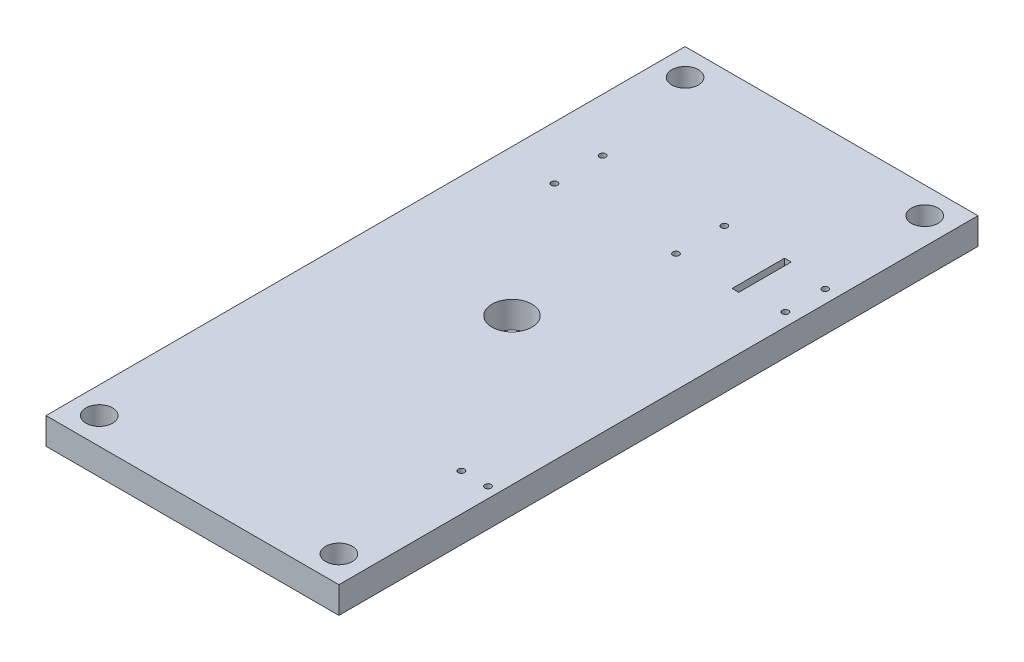
ISO-10303-21;
HEADER;
FILE_DESCRIPTION(('STEP AP214'),'2;1');
FILE_NAME('part.step','',(''),(''),'','','');
FILE_SCHEMA(('AUTOMOTIVE_DESIGN { 1 0 10303 214 1 1 1 1 }'));
ENDSEC;
DATA;
#1=APPLICATION_CONTEXT('core data for automotive mechanical design processes');
#2=APPLICATION_PROTOCOL_DEFINITION('international standard','automotive_design',2000,#1);
#3=PRODUCT_CONTEXT('',#1,'mechanical');
#4=PRODUCT('Part','Part','',(#3));
#5=PRODUCT_RELATED_PRODUCT_CATEGORY('part','',(#4));
#6=PRODUCT_DEFINITION_FORMATION('','',#4);
#7=PRODUCT_DEFINITION_CONTEXT('part definition',#1,'design');
#8=PRODUCT_DEFINITION('design','',#6,#7);
#9=PRODUCT_DEFINITION_SHAPE('','',#8);
#10=(LENGTH_UNIT() NAMED_UNIT(*) SI_UNIT(.MILLI.,.METRE.));
#11=(NAMED_UNIT(*) PLANE_ANGLE_UNIT() SI_UNIT($,.RADIAN.));
#12=(NAMED_UNIT(*) SI_UNIT($,.STERADIAN.) SOLID_ANGLE_UNIT());
#13=UNCERTAINTY_MEASURE_WITH_UNIT(LENGTH_MEASURE(1.E-05),#10,'distance_accuracy_value','');
#14=(GEOMETRIC_REPRESENTATION_CONTEXT(3) GLOBAL_UNCERTAINTY_ASSIGNED_CONTEXT((#13)) GLOBAL_UNIT_ASSIGNED_CONTEXT((#10,
#11,#12)) REPRESENTATION_CONTEXT('',''));
#15=CARTESIAN_POINT('',(0.,0.,0.));
#16=DIRECTION('',(0.,0.,1.));
#17=DIRECTION('',(1.,0.,0.));
#18=AXIS2_PLACEMENT_3D('',#15,#16,#17);
#19=CARTESIAN_POINT('',(0.,12.7,0.));
#20=DIRECTION('',(1.,0.,0.));
#21=DIRECTION('',(0.,0.,-1.));
#22=AXIS2_PLACEMENT_3D('',#19,#20,#21);
#23=PLANE('',#22);
#24=DIRECTION('',(0.,0.,1.));
#25=VECTOR('',#24,1.);
#26=CARTESIAN_POINT('',(0.,0.,0.));
#27=LINE('',#26,#25);
#28=CARTESIAN_POINT('',(0.,0.,-304.8));
#29=VERTEX_POINT('',#28);
#30=CARTESIAN_POINT('',(0.,0.,0.));
#31=VERTEX_POINT('',#30);
#32=EDGE_CURVE('E211',#29,#31,#27,.T.);
#33=ORIENTED_EDGE('',*,*,#32,.T.);
#34=DIRECTION('',(0.,-1.,0.));
#35=VECTOR('',#34,1.);
#36=CARTESIAN_POINT('',(0.,12.7,0.));
#37=LINE('',#36,#35);
#38=CARTESIAN_POINT('',(0.,12.7,0.));
#39=VERTEX_POINT('',#38);
#40=EDGE_CURVE('E11',#39,#31,#37,.T.);
#41=ORIENTED_EDGE('',*,*,#40,.F.);
#42=DIRECTION('',(0.,0.,1.));
#43=VECTOR('',#42,1.);
#44=CARTESIAN_POINT('',(0.,12.7,0.));
#45=LINE('',#44,#43);
#46=CARTESIAN_POINT('',(0.,12.7,-304.8));
#47=VERTEX_POINT('',#46);
#48=EDGE_CURVE('E214',#47,#39,#45,.T.);
#49=ORIENTED_EDGE('',*,*,#48,.F.);
#50=DIRECTION('',(0.,-1.,0.));
#51=VECTOR('',#50,1.);
#52=CARTESIAN_POINT('',(0.,12.7,-304.8));
#53=LINE('',#52,#51);
#54=EDGE_CURVE('E224',#47,#29,#53,.T.);
#55=ORIENTED_EDGE('',*,*,#54,.T.);
#56=EDGE_LOOP('',(#33,#41,#49,#55));
#57=FACE_BOUND('',#56,.T.);
#58=ADVANCED_FACE('F37',(#57),#23,.F.);
#59=CARTESIAN_POINT('',(0.,12.7,0.));
#60=DIRECTION('',(0.,0.,-1.));
#61=DIRECTION('',(-1.,0.,0.));
#62=AXIS2_PLACEMENT_3D('',#59,#60,#61);
#63=PLANE('',#62);
#64=DIRECTION('',(1.,0.,0.));
#65=VECTOR('',#64,1.);
#66=CARTESIAN_POINT('',(0.,0.,0.));
#67=LINE('',#66,#65);
#68=CARTESIAN_POINT('',(139.7,0.,0.));
#69=VERTEX_POINT('',#68);
#70=EDGE_CURVE('E227',#31,#69,#67,.T.);
#71=ORIENTED_EDGE('',*,*,#70,.T.);
#72=DIRECTION('',(0.,-1.,0.));
#73=VECTOR('',#72,1.);
#74=CARTESIAN_POINT('',(139.7,12.7,0.));
#75=LINE('',#74,#73);
#76=CARTESIAN_POINT('',(139.7,12.7,0.));
#77=VERTEX_POINT('',#76);
#78=EDGE_CURVE('E44',#77,#69,#75,.T.);
#79=ORIENTED_EDGE('',*,*,#78,.F.);
#80=DIRECTION('',(1.,0.,0.));
#81=VECTOR('',#80,1.);
#82=CARTESIAN_POINT('',(0.,12.7,0.));
#83=LINE('',#82,#81);
#84=EDGE_CURVE('E217',#39,#77,#83,.T.);
#85=ORIENTED_EDGE('',*,*,#84,.F.);
#86=ORIENTED_EDGE('',*,*,#40,.T.);
#87=EDGE_LOOP('',(#71,#79,#85,#86));
#88=FACE_BOUND('',#87,.T.);
#89=ADVANCED_FACE('F256',(#88),#63,.F.);
#90=CARTESIAN_POINT('',(139.7,12.7,0.));
#91=DIRECTION('',(-1.,0.,0.));
#92=DIRECTION('',(0.,0.,1.));
#93=AXIS2_PLACEMENT_3D('',#90,#91,#92);
#94=PLANE('',#93);
#95=DIRECTION('',(0.,0.,-1.));
#96=VECTOR('',#95,1.);
#97=CARTESIAN_POINT('',(139.7,0.,0.));
#98=LINE('',#97,#96);
#99=CARTESIAN_POINT('',(139.7,0.,-304.8));
#100=VERTEX_POINT('',#99);
#101=EDGE_CURVE('E229',#69,#100,#98,.T.);
#102=ORIENTED_EDGE('',*,*,#101,.T.);
#103=DIRECTION('',(0.,-1.,0.));
#104=VECTOR('',#103,1.);
#105=CARTESIAN_POINT('',(139.7,12.7,-304.8));
#106=LINE('',#105,#104);
#107=CARTESIAN_POINT('',(139.7,12.7,-304.8));
#108=VERTEX_POINT('',#107);
#109=EDGE_CURVE('E234',#108,#100,#106,.T.);
#110=ORIENTED_EDGE('',*,*,#109,.F.);
#111=DIRECTION('',(0.,0.,-1.));
#112=VECTOR('',#111,1.);
#113=CARTESIAN_POINT('',(139.7,12.7,0.));
#114=LINE('',#113,#112);
#115=EDGE_CURVE('E220',#77,#108,#114,.T.);
#116=ORIENTED_EDGE('',*,*,#115,.F.);
#117=ORIENTED_EDGE('',*,*,#78,.T.);
#118=EDGE_LOOP('',(#102,#110,#116,#117));
#119=FACE_BOUND('',#118,.T.);
#120=ADVANCED_FACE('F241',(#119),#94,.F.);
#121=CARTESIAN_POINT('',(0.,12.7,-304.8));
#122=DIRECTION('',(0.,0.,1.));
#123=DIRECTION('',(1.,0.,0.));
#124=AXIS2_PLACEMENT_3D('',#121,#122,#123);
#125=PLANE('',#124);
#126=DIRECTION('',(-1.,0.,0.));
#127=VECTOR('',#126,1.);
#128=CARTESIAN_POINT('',(0.,0.,-304.8));
#129=LINE('',#128,#127);
#130=EDGE_CURVE('E218',#100,#29,#129,.T.);
#131=ORIENTED_EDGE('',*,*,#130,.T.);
#132=ORIENTED_EDGE('',*,*,#54,.F.);
#133=DIRECTION('',(-1.,0.,0.));
#134=VECTOR('',#133,1.);
#135=CARTESIAN_POINT('',(0.,12.7,-304.8));
#136=LINE('',#135,#134);
#137=EDGE_CURVE('E222',#108,#47,#136,.T.);
#138=ORIENTED_EDGE('',*,*,#137,.F.);
#139=ORIENTED_EDGE('',*,*,#109,.T.);
#140=EDGE_LOOP('',(#131,#132,#138,#139));
#141=FACE_BOUND('',#140,.T.);
#142=ADVANCED_FACE('F249',(#141),#125,.F.);
#143=CARTESIAN_POINT('',(0.,12.7,0.));
#144=DIRECTION('',(0.,-1.,0.));
#145=DIRECTION('',(0.,0.,-1.));
#146=AXIS2_PLACEMENT_3D('',#143,#144,#145);
#147=PLANE('',#146);
#148=DIRECTION('',(1.,0.,0.));
#149=VECTOR('',#148,1.);
#150=CARTESIAN_POINT('',(111.125,12.7,-216.1));
#151=LINE('',#150,#149);
#152=CARTESIAN_POINT('',(111.125,12.7,-216.1));
#153=VERTEX_POINT('',#152);
#154=CARTESIAN_POINT('',(114.3,12.7,-216.1));
#155=VERTEX_POINT('',#154);
#156=EDGE_CURVE('E131',#153,#155,#151,.T.);
#157=ORIENTED_EDGE('',*,*,#156,.F.);
#158=DIRECTION('',(0.,0.,1.));
#159=VECTOR('',#158,1.);
#160=CARTESIAN_POINT('',(111.125,12.7,-216.1));
#161=LINE('',#160,#159);
#162=CARTESIAN_POINT('',(111.125,12.7,-241.1));
#163=VERTEX_POINT('',#162);
#164=EDGE_CURVE('E51',#163,#153,#161,.T.);
#165=ORIENTED_EDGE('',*,*,#164,.F.);
#166=DIRECTION('',(-1.,0.,0.));
#167=VECTOR('',#166,1.);
#168=CARTESIAN_POINT('',(111.125,12.7,-241.1));
#169=LINE('',#168,#167);
#170=CARTESIAN_POINT('',(114.3,12.7,-241.1));
#171=VERTEX_POINT('',#170);
#172=EDGE_CURVE('E119',#171,#163,#169,.T.);
#173=ORIENTED_EDGE('',*,*,#172,.F.);
#174=DIRECTION('',(0.,0.,-1.));
#175=VECTOR('',#174,1.);
#176=CARTESIAN_POINT('',(114.3,12.7,-216.1));
#177=LINE('',#176,#175);
#178=EDGE_CURVE('E122',#155,#171,#177,.T.);
#179=ORIENTED_EDGE('',*,*,#178,.F.);
#180=EDGE_LOOP('',(#157,#165,#173,#179));
#181=FACE_BOUND('',#180,.T.);
#182=CARTESIAN_POINT('',(133.52,12.7,-238.10000005));
#183=DIRECTION('',(0.,1.,0.));
#184=DIRECTION('',(0.,0.,1.));
#185=AXIS2_PLACEMENT_3D('',#182,#183,#184);
#186=CIRCLE('',#185,1.5);
#187=CARTESIAN_POINT('',(133.52,12.7,-236.60000005));
#188=VERTEX_POINT('',#187);
#189=EDGE_CURVE('E125',#188,#188,#186,.T.);
#190=ORIENTED_EDGE('',*,*,#189,.F.);
#191=EDGE_LOOP('',(#190));
#192=FACE_BOUND('',#191,.T.);
#193=CARTESIAN_POINT('',(133.52,12.7,-219.09999995));
#194=DIRECTION('',(0.,1.,0.));
#195=DIRECTION('',(0.,0.,1.));
#196=AXIS2_PLACEMENT_3D('',#193,#194,#195);
#197=CIRCLE('',#196,1.5);
#198=CARTESIAN_POINT('',(133.52,12.7,-217.59999995));
#199=VERTEX_POINT('',#198);
#200=EDGE_CURVE('E144',#199,#199,#197,.T.);
#201=ORIENTED_EDGE('',*,*,#200,.F.);
#202=EDGE_LOOP('',(#201));
#203=FACE_BOUND('',#202,.T.);
#204=CARTESIAN_POINT('',(134.62,12.7,-76.2));
#205=DIRECTION('',(0.,1.,0.));
#206=DIRECTION('',(0.,0.,1.));
#207=AXIS2_PLACEMENT_3D('',#204,#205,#206);
#208=CIRCLE('',#207,1.5);
#209=CARTESIAN_POINT('',(134.62,12.7,-74.7));
#210=VERTEX_POINT('',#209);
#211=EDGE_CURVE('E152',#210,#210,#208,.T.);
#212=ORIENTED_EDGE('',*,*,#211,.F.);
#213=EDGE_LOOP('',(#212));
#214=FACE_BOUND('',#213,.T.);
#215=CARTESIAN_POINT('',(121.92,12.7,-76.2));
#216=DIRECTION('',(0.,1.,0.));
#217=DIRECTION('',(0.,0.,1.));
#218=AXIS2_PLACEMENT_3D('',#215,#216,#217);
#219=CIRCLE('',#218,1.5);
#220=CARTESIAN_POINT('',(121.92,12.7,-74.7));
#221=VERTEX_POINT('',#220);
#222=EDGE_CURVE('E143',#221,#221,#219,.T.);
#223=ORIENTED_EDGE('',*,*,#222,.F.);
#224=EDGE_LOOP('',(#223));
#225=FACE_BOUND('',#224,.T.);
#226=CARTESIAN_POINT('',(83.400011,12.7,-217.0999976));
#227=DIRECTION('',(0.,1.,0.));
#228=DIRECTION('',(0.,0.,1.));
#229=AXIS2_PLACEMENT_3D('',#226,#227,#228);
#230=CIRCLE('',#229,1.5);
#231=CARTESIAN_POINT('',(83.400011,12.7,-215.5999976));
#232=VERTEX_POINT('',#231);
#233=EDGE_CURVE('E151',#232,#232,#230,.T.);
#234=ORIENTED_EDGE('',*,*,#233,.F.);
#235=EDGE_LOOP('',(#234));
#236=FACE_BOUND('',#235,.T.);
#237=CARTESIAN_POINT('',(83.400011,12.7,-240.1000024));
#238=DIRECTION('',(0.,1.,0.));
#239=DIRECTION('',(0.,0.,1.));
#240=AXIS2_PLACEMENT_3D('',#237,#238,#239);
#241=CIRCLE('',#240,1.5);
#242=CARTESIAN_POINT('',(83.400011,12.7,-238.6000024));
#243=VERTEX_POINT('',#242);
#244=EDGE_CURVE('E170',#243,#243,#241,.T.);
#245=ORIENTED_EDGE('',*,*,#244,.F.);
#246=EDGE_LOOP('',(#245));
#247=FACE_BOUND('',#246,.T.);
#248=CARTESIAN_POINT('',(25.4,12.7,-240.1000024));
#249=DIRECTION('',(0.,1.,0.));
#250=DIRECTION('',(0.,0.,1.));
#251=AXIS2_PLACEMENT_3D('',#248,#249,#250);
#252=CIRCLE('',#251,1.5);
#253=CARTESIAN_POINT('',(25.4,12.7,-238.6000024));
#254=VERTEX_POINT('',#253);
#255=EDGE_CURVE('E164',#254,#254,#252,.T.);
#256=ORIENTED_EDGE('',*,*,#255,.F.);
#257=EDGE_LOOP('',(#256));
#258=FACE_BOUND('',#257,.T.);
#259=CARTESIAN_POINT('',(25.4,12.7,-217.0999976));
#260=DIRECTION('',(0.,1.,0.));
#261=DIRECTION('',(0.,0.,1.));
#262=AXIS2_PLACEMENT_3D('',#259,#260,#261);
#263=CIRCLE('',#262,1.5);
#264=CARTESIAN_POINT('',(25.4,12.7,-215.5999976));
#265=VERTEX_POINT('',#264);
#266=EDGE_CURVE('E163',#265,#265,#263,.T.);
#267=ORIENTED_EDGE('',*,*,#266,.F.);
#268=EDGE_LOOP('',(#267));
#269=FACE_BOUND('',#268,.T.);
#270=CARTESIAN_POINT('',(69.85,12.7,-152.4));
#271=DIRECTION('',(0.,1.,0.));
#272=DIRECTION('',(0.,0.,1.));
#273=AXIS2_PLACEMENT_3D('',#270,#271,#272);
#274=CIRCLE('',#273,9.52499999999999);
#275=CARTESIAN_POINT('',(69.85,12.7,-142.875));
#276=VERTEX_POINT('',#275);
#277=EDGE_CURVE('E181',#276,#276,#274,.T.);
#278=ORIENTED_EDGE('',*,*,#277,.F.);
#279=EDGE_LOOP('',(#278));
#280=FACE_BOUND('',#279,.T.);
#281=CARTESIAN_POINT('',(12.7,12.7,-12.7));
#282=DIRECTION('',(0.,1.,0.));
#283=DIRECTION('',(0.,0.,1.));
#284=AXIS2_PLACEMENT_3D('',#281,#282,#283);
#285=CIRCLE('',#284,6.35);
#286=CARTESIAN_POINT('',(12.7,12.7,-6.35));
#287=VERTEX_POINT('',#286);
#288=EDGE_CURVE('E189',#287,#287,#285,.T.);
#289=ORIENTED_EDGE('',*,*,#288,.F.);
#290=EDGE_LOOP('',(#289));
#291=FACE_BOUND('',#290,.T.);
#292=CARTESIAN_POINT('',(12.6999999999999,12.7,-292.1));
#293=DIRECTION('',(0.,1.,0.));
#294=DIRECTION('',(0.,0.,-1.));
#295=AXIS2_PLACEMENT_3D('',#292,#293,#294);
#296=CIRCLE('',#295,6.35000000000001);
#297=CARTESIAN_POINT('',(12.6999999999999,12.7,-298.45));
#298=VERTEX_POINT('',#297);
#299=EDGE_CURVE('E200',#298,#298,#296,.T.);
#300=ORIENTED_EDGE('',*,*,#299,.F.);
#301=EDGE_LOOP('',(#300));
#302=FACE_BOUND('',#301,.T.);
#303=CARTESIAN_POINT('',(127.,12.7,-292.1));
#304=DIRECTION('',(0.,1.,0.));
#305=DIRECTION('',(0.,0.,1.));
#306=AXIS2_PLACEMENT_3D('',#303,#304,#305);
#307=CIRCLE('',#306,6.35000000000001);
#308=CARTESIAN_POINT('',(127.,12.7,-285.75));
#309=VERTEX_POINT('',#308);
#310=EDGE_CURVE('E194',#309,#309,#307,.T.);
#311=ORIENTED_EDGE('',*,*,#310,.F.);
#312=EDGE_LOOP('',(#311));
#313=FACE_BOUND('',#312,.T.);
#314=CARTESIAN_POINT('',(127.,12.7,-12.7000000000002));
#315=DIRECTION('',(0.,1.,0.));
#316=DIRECTION('',(0.,0.,-1.));
#317=AXIS2_PLACEMENT_3D('',#314,#315,#316);
#318=CIRCLE('',#317,6.35);
#319=CARTESIAN_POINT('',(127.,12.7,-19.0500000000002));
#320=VERTEX_POINT('',#319);
#321=EDGE_CURVE('E193',#320,#320,#318,.T.);
#322=ORIENTED_EDGE('',*,*,#321,.F.);
#323=EDGE_LOOP('',(#322));
#324=FACE_BOUND('',#323,.T.);
#325=ORIENTED_EDGE('',*,*,#48,.T.);
#326=ORIENTED_EDGE('',*,*,#84,.T.);
#327=ORIENTED_EDGE('',*,*,#115,.T.);
#328=ORIENTED_EDGE('',*,*,#137,.T.);
#329=EDGE_LOOP('',(#325,#326,#327,#328));
#330=FACE_BOUND('',#329,.T.);
#331=ADVANCED_FACE('F255',(#181,#192,#203,#214,#225,#236,#247,#258,#269,#280,#291,#302,#313,
#324,#330),#147,.F.);
#332=CARTESIAN_POINT('',(0.,0.,0.));
#333=DIRECTION('',(0.,-1.,0.));
#334=DIRECTION('',(0.,0.,-1.));
#335=AXIS2_PLACEMENT_3D('',#332,#333,#334);
#336=PLANE('',#335);
#337=DIRECTION('',(0.,0.,1.));
#338=VECTOR('',#337,1.);
#339=CARTESIAN_POINT('',(111.125,0.,-216.1));
#340=LINE('',#339,#338);
#341=CARTESIAN_POINT('',(111.125,0.,-241.1));
#342=VERTEX_POINT('',#341);
#343=CARTESIAN_POINT('',(111.125,0.,-216.1));
#344=VERTEX_POINT('',#343);
#345=EDGE_CURVE('E103',#342,#344,#340,.T.);
#346=ORIENTED_EDGE('',*,*,#345,.T.);
#347=DIRECTION('',(1.,0.,0.));
#348=VECTOR('',#347,1.);
#349=CARTESIAN_POINT('',(111.125,0.,-216.1));
#350=LINE('',#349,#348);
#351=CARTESIAN_POINT('',(114.3,0.,-216.1));
#352=VERTEX_POINT('',#351);
#353=EDGE_CURVE('E112',#344,#352,#350,.T.);
#354=ORIENTED_EDGE('',*,*,#353,.T.);
#355=DIRECTION('',(0.,0.,-1.));
#356=VECTOR('',#355,1.);
#357=CARTESIAN_POINT('',(114.3,0.,-216.1));
#358=LINE('',#357,#356);
#359=CARTESIAN_POINT('',(114.3,0.,-241.1));
#360=VERTEX_POINT('',#359);
#361=EDGE_CURVE('E59',#352,#360,#358,.T.);
#362=ORIENTED_EDGE('',*,*,#361,.T.);
#363=DIRECTION('',(-1.,0.,0.));
#364=VECTOR('',#363,1.);
#365=CARTESIAN_POINT('',(111.125,0.,-241.1));
#366=LINE('',#365,#364);
#367=EDGE_CURVE('E109',#360,#342,#366,.T.);
#368=ORIENTED_EDGE('',*,*,#367,.T.);
#369=EDGE_LOOP('',(#346,#354,#362,#368));
#370=FACE_BOUND('',#369,.T.);
#371=CARTESIAN_POINT('',(133.52,0.,-238.10000005));
#372=DIRECTION('',(0.,1.,0.));
#373=DIRECTION('',(0.,0.,1.));
#374=AXIS2_PLACEMENT_3D('',#371,#372,#373);
#375=CIRCLE('',#374,1.5);
#376=CARTESIAN_POINT('',(133.52,0.,-236.60000005));
#377=VERTEX_POINT('',#376);
#378=EDGE_CURVE('E147',#377,#377,#375,.T.);
#379=ORIENTED_EDGE('',*,*,#378,.T.);
#380=EDGE_LOOP('',(#379));
#381=FACE_BOUND('',#380,.T.);
#382=CARTESIAN_POINT('',(133.52,0.,-219.09999995));
#383=DIRECTION('',(0.,1.,0.));
#384=DIRECTION('',(0.,0.,1.));
#385=AXIS2_PLACEMENT_3D('',#382,#383,#384);
#386=CIRCLE('',#385,1.5);
#387=CARTESIAN_POINT('',(133.52,0.,-217.59999995));
#388=VERTEX_POINT('',#387);
#389=EDGE_CURVE('E140',#388,#388,#386,.T.);
#390=ORIENTED_EDGE('',*,*,#389,.T.);
#391=EDGE_LOOP('',(#390));
#392=FACE_BOUND('',#391,.T.);
#393=CARTESIAN_POINT('',(134.62,0.,-76.2));
#394=DIRECTION('',(0.,1.,0.));
#395=DIRECTION('',(0.,0.,1.));
#396=AXIS2_PLACEMENT_3D('',#393,#394,#395);
#397=CIRCLE('',#396,1.5);
#398=CARTESIAN_POINT('',(134.62,0.,-74.7));
#399=VERTEX_POINT('',#398);
#400=EDGE_CURVE('E148',#399,#399,#397,.T.);
#401=ORIENTED_EDGE('',*,*,#400,.T.);
#402=EDGE_LOOP('',(#401));
#403=FACE_BOUND('',#402,.T.);
#404=CARTESIAN_POINT('',(121.92,0.,-76.2));
#405=DIRECTION('',(0.,1.,0.));
#406=DIRECTION('',(0.,0.,1.));
#407=AXIS2_PLACEMENT_3D('',#404,#405,#406);
#408=CIRCLE('',#407,1.5);
#409=CARTESIAN_POINT('',(121.92,0.,-74.7));
#410=VERTEX_POINT('',#409);
#411=EDGE_CURVE('E155',#410,#410,#408,.T.);
#412=ORIENTED_EDGE('',*,*,#411,.T.);
#413=EDGE_LOOP('',(#412));
#414=FACE_BOUND('',#413,.T.);
#415=CARTESIAN_POINT('',(83.400011,0.,-217.0999976));
#416=DIRECTION('',(0.,1.,0.));
#417=DIRECTION('',(0.,0.,1.));
#418=AXIS2_PLACEMENT_3D('',#415,#416,#417);
#419=CIRCLE('',#418,1.5);
#420=CARTESIAN_POINT('',(83.400011,0.,-215.5999976));
#421=VERTEX_POINT('',#420);
#422=EDGE_CURVE('E173',#421,#421,#419,.T.);
#423=ORIENTED_EDGE('',*,*,#422,.T.);
#424=EDGE_LOOP('',(#423));
#425=FACE_BOUND('',#424,.T.);
#426=CARTESIAN_POINT('',(83.400011,0.,-240.1000024));
#427=DIRECTION('',(0.,1.,0.));
#428=DIRECTION('',(0.,0.,1.));
#429=AXIS2_PLACEMENT_3D('',#426,#427,#428);
#430=CIRCLE('',#429,1.5);
#431=CARTESIAN_POINT('',(83.400011,0.,-238.6000024));
#432=VERTEX_POINT('',#431);
#433=EDGE_CURVE('E167',#432,#432,#430,.T.);
#434=ORIENTED_EDGE('',*,*,#433,.T.);
#435=EDGE_LOOP('',(#434));
#436=FACE_BOUND('',#435,.T.);
#437=CARTESIAN_POINT('',(25.4,0.,-240.1000024));
#438=DIRECTION('',(0.,1.,0.));
#439=DIRECTION('',(0.,0.,1.));
#440=AXIS2_PLACEMENT_3D('',#437,#438,#439);
#441=CIRCLE('',#440,1.5);
#442=CARTESIAN_POINT('',(25.4,0.,-238.6000024));
#443=VERTEX_POINT('',#442);
#444=EDGE_CURVE('E160',#443,#443,#441,.T.);
#445=ORIENTED_EDGE('',*,*,#444,.T.);
#446=EDGE_LOOP('',(#445));
#447=FACE_BOUND('',#446,.T.);
#448=CARTESIAN_POINT('',(25.4,0.,-217.0999976));
#449=DIRECTION('',(0.,1.,0.));
#450=DIRECTION('',(0.,0.,1.));
#451=AXIS2_PLACEMENT_3D('',#448,#449,#450);
#452=CIRCLE('',#451,1.5);
#453=CARTESIAN_POINT('',(25.4,0.,-215.5999976));
#454=VERTEX_POINT('',#453);
#455=EDGE_CURVE('E178',#454,#454,#452,.T.);
#456=ORIENTED_EDGE('',*,*,#455,.T.);
#457=EDGE_LOOP('',(#456));
#458=FACE_BOUND('',#457,.T.);
#459=CARTESIAN_POINT('',(69.85,0.,-152.4));
#460=DIRECTION('',(0.,-1.,0.));
#461=DIRECTION('',(0.,0.,-1.));
#462=AXIS2_PLACEMENT_3D('',#459,#460,#461);
#463=CIRCLE('',#462,9.52499999999998);
#464=CARTESIAN_POINT('',(69.85,0.,-161.925));
#465=VERTEX_POINT('',#464);
#466=EDGE_CURVE('E186',#465,#465,#463,.T.);
#467=ORIENTED_EDGE('',*,*,#466,.F.);
#468=EDGE_LOOP('',(#467));
#469=FACE_BOUND('',#468,.T.);
#470=CARTESIAN_POINT('',(12.7,0.,-12.7));
#471=DIRECTION('',(0.,1.,0.));
#472=DIRECTION('',(0.,0.,1.));
#473=AXIS2_PLACEMENT_3D('',#470,#471,#472);
#474=CIRCLE('',#473,6.35);
#475=CARTESIAN_POINT('',(12.7,0.,-6.35));
#476=VERTEX_POINT('',#475);
#477=EDGE_CURVE('E203',#476,#476,#474,.T.);
#478=ORIENTED_EDGE('',*,*,#477,.T.);
#479=EDGE_LOOP('',(#478));
#480=FACE_BOUND('',#479,.T.);
#481=CARTESIAN_POINT('',(12.6999999999999,0.,-292.1));
#482=DIRECTION('',(0.,1.,0.));
#483=DIRECTION('',(0.,0.,-1.));
#484=AXIS2_PLACEMENT_3D('',#481,#482,#483);
#485=CIRCLE('',#484,6.35000000000001);
#486=CARTESIAN_POINT('',(12.6999999999999,0.,-298.45));
#487=VERTEX_POINT('',#486);
#488=EDGE_CURVE('E197',#487,#487,#485,.T.);
#489=ORIENTED_EDGE('',*,*,#488,.T.);
#490=EDGE_LOOP('',(#489));
#491=FACE_BOUND('',#490,.T.);
#492=CARTESIAN_POINT('',(127.,0.,-292.1));
#493=DIRECTION('',(0.,1.,0.));
#494=DIRECTION('',(0.,0.,1.));
#495=AXIS2_PLACEMENT_3D('',#492,#493,#494);
#496=CIRCLE('',#495,6.35000000000001);
#497=CARTESIAN_POINT('',(127.,0.,-285.75));
#498=VERTEX_POINT('',#497);
#499=EDGE_CURVE('E190',#498,#498,#496,.T.);
#500=ORIENTED_EDGE('',*,*,#499,.T.);
#501=EDGE_LOOP('',(#500));
#502=FACE_BOUND('',#501,.T.);
#503=CARTESIAN_POINT('',(127.,0.,-12.7000000000002));
#504=DIRECTION('',(0.,1.,0.));
#505=DIRECTION('',(0.,0.,-1.));
#506=AXIS2_PLACEMENT_3D('',#503,#504,#505);
#507=CIRCLE('',#506,6.35);
#508=CARTESIAN_POINT('',(127.,0.,-19.0500000000002));
#509=VERTEX_POINT('',#508);
#510=EDGE_CURVE('E208',#509,#509,#507,.T.);
#511=ORIENTED_EDGE('',*,*,#510,.T.);
#512=EDGE_LOOP('',(#511));
#513=FACE_BOUND('',#512,.T.);
#514=ORIENTED_EDGE('',*,*,#32,.F.);
#515=ORIENTED_EDGE('',*,*,#130,.F.);
#516=ORIENTED_EDGE('',*,*,#101,.F.);
#517=ORIENTED_EDGE('',*,*,#70,.F.);
#518=EDGE_LOOP('',(#514,#515,#516,#517));
#519=FACE_BOUND('',#518,.T.);
#520=ADVANCED_FACE('F116',(#370,#381,#392,#403,#414,#425,#436,#447,#458,#469,#480,#491,#502,
#513,#519),#336,.T.);
#521=CARTESIAN_POINT('',(127.,0.,-12.7000000000002));
#522=DIRECTION('',(0.,1.,0.));
#523=DIRECTION('',(0.,0.,1.));
#524=AXIS2_PLACEMENT_3D('',#521,#522,#523);
#525=CYLINDRICAL_SURFACE('',#524,6.35);
#526=ORIENTED_EDGE('',*,*,#510,.F.);
#527=EDGE_LOOP('',(#526));
#528=FACE_BOUND('',#527,.T.);
#529=ORIENTED_EDGE('',*,*,#321,.T.);
#530=EDGE_LOOP('',(#529));
#531=FACE_BOUND('',#530,.T.);
#532=ADVANCED_FACE('F268',(#528,#531),#525,.F.);
#533=CARTESIAN_POINT('',(127.,0.,-292.1));
#534=DIRECTION('',(0.,1.,0.));
#535=DIRECTION('',(0.,0.,1.));
#536=AXIS2_PLACEMENT_3D('',#533,#534,#535);
#537=CYLINDRICAL_SURFACE('',#536,6.35000000000001);
#538=ORIENTED_EDGE('',*,*,#499,.F.);
#539=EDGE_LOOP('',(#538));
#540=FACE_BOUND('',#539,.T.);
#541=ORIENTED_EDGE('',*,*,#310,.T.);
#542=EDGE_LOOP('',(#541));
#543=FACE_BOUND('',#542,.T.);
#544=ADVANCED_FACE('F274',(#540,#543),#537,.F.);
#545=CARTESIAN_POINT('',(12.6999999999999,0.,-292.1));
#546=DIRECTION('',(0.,1.,0.));
#547=DIRECTION('',(0.,0.,1.));
#548=AXIS2_PLACEMENT_3D('',#545,#546,#547);
#549=CYLINDRICAL_SURFACE('',#548,6.35000000000001);
#550=ORIENTED_EDGE('',*,*,#488,.F.);
#551=EDGE_LOOP('',(#550));
#552=FACE_BOUND('',#551,.T.);
#553=ORIENTED_EDGE('',*,*,#299,.T.);
#554=EDGE_LOOP('',(#553));
#555=FACE_BOUND('',#554,.T.);
#556=ADVANCED_FACE('F280',(#552,#555),#549,.F.);
#557=CARTESIAN_POINT('',(12.7,0.,-12.7));
#558=DIRECTION('',(0.,1.,0.));
#559=DIRECTION('',(0.,0.,1.));
#560=AXIS2_PLACEMENT_3D('',#557,#558,#559);
#561=CYLINDRICAL_SURFACE('',#560,6.35);
#562=ORIENTED_EDGE('',*,*,#477,.F.);
#563=EDGE_LOOP('',(#562));
#564=FACE_BOUND('',#563,.T.);
#565=ORIENTED_EDGE('',*,*,#288,.T.);
#566=EDGE_LOOP('',(#565));
#567=FACE_BOUND('',#566,.T.);
#568=ADVANCED_FACE('F276',(#564,#567),#561,.F.);
#569=CARTESIAN_POINT('',(69.85,12.7,-152.4));
#570=DIRECTION('',(0.,1.,0.));
#571=DIRECTION('',(0.,0.,1.));
#572=AXIS2_PLACEMENT_3D('',#569,#570,#571);
#573=CYLINDRICAL_SURFACE('',#572,9.52499999999998);
#574=ORIENTED_EDGE('',*,*,#466,.T.);
#575=EDGE_LOOP('',(#574));
#576=FACE_BOUND('',#575,.T.);
#577=ORIENTED_EDGE('',*,*,#277,.T.);
#578=EDGE_LOOP('',(#577));
#579=FACE_BOUND('',#578,.T.);
#580=ADVANCED_FACE('F279',(#576,#579),#573,.F.);
#581=CARTESIAN_POINT('',(25.4,0.,-217.0999976));
#582=DIRECTION('',(0.,1.,0.));
#583=DIRECTION('',(0.,0.,1.));
#584=AXIS2_PLACEMENT_3D('',#581,#582,#583);
#585=CYLINDRICAL_SURFACE('',#584,1.5);
#586=ORIENTED_EDGE('',*,*,#455,.F.);
#587=EDGE_LOOP('',(#586));
#588=FACE_BOUND('',#587,.T.);
#589=ORIENTED_EDGE('',*,*,#266,.T.);
#590=EDGE_LOOP('',(#589));
#591=FACE_BOUND('',#590,.T.);
#592=ADVANCED_FACE('F290',(#588,#591),#585,.F.);
#593=CARTESIAN_POINT('',(25.4,0.,-240.1000024));
#594=DIRECTION('',(0.,1.,0.));
#595=DIRECTION('',(0.,0.,1.));
#596=AXIS2_PLACEMENT_3D('',#593,#594,#595);
#597=CYLINDRICAL_SURFACE('',#596,1.5);
#598=ORIENTED_EDGE('',*,*,#444,.F.);
#599=EDGE_LOOP('',(#598));
#600=FACE_BOUND('',#599,.T.);
#601=ORIENTED_EDGE('',*,*,#255,.T.);
#602=EDGE_LOOP('',(#601));
#603=FACE_BOUND('',#602,.T.);
#604=ADVANCED_FACE('F294',(#600,#603),#597,.F.);
#605=CARTESIAN_POINT('',(83.400011,0.,-240.1000024));
#606=DIRECTION('',(0.,1.,0.));
#607=DIRECTION('',(0.,0.,1.));
#608=AXIS2_PLACEMENT_3D('',#605,#606,#607);
#609=CYLINDRICAL_SURFACE('',#608,1.5);
#610=ORIENTED_EDGE('',*,*,#433,.F.);
#611=EDGE_LOOP('',(#610));
#612=FACE_BOUND('',#611,.T.);
#613=ORIENTED_EDGE('',*,*,#244,.T.);
#614=EDGE_LOOP('',(#613));
#615=FACE_BOUND('',#614,.T.);
#616=ADVANCED_FACE('F300',(#612,#615),#609,.F.);
#617=CARTESIAN_POINT('',(83.400011,0.,-217.0999976));
#618=DIRECTION('',(0.,1.,0.));
#619=DIRECTION('',(0.,0.,1.));
#620=AXIS2_PLACEMENT_3D('',#617,#618,#619);
#621=CYLINDRICAL_SURFACE('',#620,1.5);
#622=ORIENTED_EDGE('',*,*,#422,.F.);
#623=EDGE_LOOP('',(#622));
#624=FACE_BOUND('',#623,.T.);
#625=ORIENTED_EDGE('',*,*,#233,.T.);
#626=EDGE_LOOP('',(#625));
#627=FACE_BOUND('',#626,.T.);
#628=ADVANCED_FACE('F296',(#624,#627),#621,.F.);
#629=CARTESIAN_POINT('',(121.92,0.,-76.2));
#630=DIRECTION('',(0.,1.,0.));
#631=DIRECTION('',(0.,0.,1.));
#632=AXIS2_PLACEMENT_3D('',#629,#630,#631);
#633=CYLINDRICAL_SURFACE('',#632,1.5);
#634=ORIENTED_EDGE('',*,*,#411,.F.);
#635=EDGE_LOOP('',(#634));
#636=FACE_BOUND('',#635,.T.);
#637=ORIENTED_EDGE('',*,*,#222,.T.);
#638=EDGE_LOOP('',(#637));
#639=FACE_BOUND('',#638,.T.);
#640=ADVANCED_FACE('F299',(#636,#639),#633,.F.);
#641=CARTESIAN_POINT('',(134.62,0.,-76.2));
#642=DIRECTION('',(0.,1.,0.));
#643=DIRECTION('',(0.,0.,1.));
#644=AXIS2_PLACEMENT_3D('',#641,#642,#643);
#645=CYLINDRICAL_SURFACE('',#644,1.5);
#646=ORIENTED_EDGE('',*,*,#400,.F.);
#647=EDGE_LOOP('',(#646));
#648=FACE_BOUND('',#647,.T.);
#649=ORIENTED_EDGE('',*,*,#211,.T.);
#650=EDGE_LOOP('',(#649));
#651=FACE_BOUND('',#650,.T.);
#652=ADVANCED_FACE('F310',(#648,#651),#645,.F.);
#653=CARTESIAN_POINT('',(133.52,0.,-219.09999995));
#654=DIRECTION('',(0.,1.,0.));
#655=DIRECTION('',(0.,0.,1.));
#656=AXIS2_PLACEMENT_3D('',#653,#654,#655);
#657=CYLINDRICAL_SURFACE('',#656,1.5);
#658=ORIENTED_EDGE('',*,*,#389,.F.);
#659=EDGE_LOOP('',(#658));
#660=FACE_BOUND('',#659,.T.);
#661=ORIENTED_EDGE('',*,*,#200,.T.);
#662=EDGE_LOOP('',(#661));
#663=FACE_BOUND('',#662,.T.);
#664=ADVANCED_FACE('F314',(#660,#663),#657,.F.);
#665=CARTESIAN_POINT('',(133.52,0.,-238.10000005));
#666=DIRECTION('',(0.,1.,0.));
#667=DIRECTION('',(0.,0.,1.));
#668=AXIS2_PLACEMENT_3D('',#665,#666,#667);
#669=CYLINDRICAL_SURFACE('',#668,1.5);
#670=ORIENTED_EDGE('',*,*,#378,.F.);
#671=EDGE_LOOP('',(#670));
#672=FACE_BOUND('',#671,.T.);
#673=ORIENTED_EDGE('',*,*,#189,.T.);
#674=EDGE_LOOP('',(#673));
#675=FACE_BOUND('',#674,.T.);
#676=ADVANCED_FACE('F318',(#672,#675),#669,.F.);
#677=CARTESIAN_POINT('',(111.125,0.,-216.1));
#678=DIRECTION('',(-1.,0.,0.));
#679=DIRECTION('',(0.,0.,1.));
#680=AXIS2_PLACEMENT_3D('',#677,#678,#679);
#681=PLANE('',#680);
#682=ORIENTED_EDGE('',*,*,#164,.T.);
#683=DIRECTION('',(0.,1.,0.));
#684=VECTOR('',#683,1.);
#685=CARTESIAN_POINT('',(111.125,0.,-216.1));
#686=LINE('',#685,#684);
#687=EDGE_CURVE('E99',#344,#153,#686,.T.);
#688=ORIENTED_EDGE('',*,*,#687,.F.);
#689=ORIENTED_EDGE('',*,*,#345,.F.);
#690=DIRECTION('',(0.,1.,0.));
#691=VECTOR('',#690,1.);
#692=CARTESIAN_POINT('',(111.125,0.,-241.1));
#693=LINE('',#692,#691);
#694=EDGE_CURVE('E135',#342,#163,#693,.T.);
#695=ORIENTED_EDGE('',*,*,#694,.T.);
#696=EDGE_LOOP('',(#682,#688,#689,#695));
#697=FACE_BOUND('',#696,.T.);
#698=ADVANCED_FACE('F101',(#697),#681,.F.);
#699=CARTESIAN_POINT('',(111.125,0.,-241.1));
#700=DIRECTION('',(0.,0.,-1.));
#701=DIRECTION('',(-1.,0.,0.));
#702=AXIS2_PLACEMENT_3D('',#699,#700,#701);
#703=PLANE('',#702);
#704=ORIENTED_EDGE('',*,*,#172,.T.);
#705=ORIENTED_EDGE('',*,*,#694,.F.);
#706=ORIENTED_EDGE('',*,*,#367,.F.);
#707=DIRECTION('',(0.,1.,0.));
#708=VECTOR('',#707,1.);
#709=CARTESIAN_POINT('',(114.3,0.,-241.1));
#710=LINE('',#709,#708);
#711=EDGE_CURVE('E137',#360,#171,#710,.T.);
#712=ORIENTED_EDGE('',*,*,#711,.T.);
#713=EDGE_LOOP('',(#704,#705,#706,#712));
#714=FACE_BOUND('',#713,.T.);
#715=ADVANCED_FACE('F322',(#714),#703,.F.);
#716=CARTESIAN_POINT('',(114.3,0.,-216.1));
#717=DIRECTION('',(1.,0.,0.));
#718=DIRECTION('',(0.,0.,-1.));
#719=AXIS2_PLACEMENT_3D('',#716,#717,#718);
#720=PLANE('',#719);
#721=ORIENTED_EDGE('',*,*,#178,.T.);
#722=ORIENTED_EDGE('',*,*,#711,.F.);
#723=ORIENTED_EDGE('',*,*,#361,.F.);
#724=DIRECTION('',(0.,1.,0.));
#725=VECTOR('',#724,1.);
#726=CARTESIAN_POINT('',(114.3,0.,-216.1));
#727=LINE('',#726,#725);
#728=EDGE_CURVE('E108',#352,#155,#727,.T.);
#729=ORIENTED_EDGE('',*,*,#728,.T.);
#730=EDGE_LOOP('',(#721,#722,#723,#729));
#731=FACE_BOUND('',#730,.T.);
#732=ADVANCED_FACE('F325',(#731),#720,.F.);
#733=CARTESIAN_POINT('',(111.125,0.,-216.1));
#734=DIRECTION('',(0.,0.,1.));
#735=DIRECTION('',(1.,0.,0.));
#736=AXIS2_PLACEMENT_3D('',#733,#734,#735);
#737=PLANE('',#736);
#738=ORIENTED_EDGE('',*,*,#156,.T.);
#739=ORIENTED_EDGE('',*,*,#728,.F.);
#740=ORIENTED_EDGE('',*,*,#353,.F.);
#741=ORIENTED_EDGE('',*,*,#687,.T.);
#742=EDGE_LOOP('',(#738,#739,#740,#741));
#743=FACE_BOUND('',#742,.T.);
#744=ADVANCED_FACE('F113',(#743),#737,.F.);
#745=CLOSED_SHELL('',(#58,#89,#120,#142,#331,#520,#532,#544,#556,#568,#580,#592,#604,#616,#628,
#640,#652,#664,#676,#698,#715,#732,#744));
#746=MANIFOLD_SOLID_BREP('B2',#745);
#747=ADVANCED_BREP_SHAPE_REPRESENTATION('',(#18,#746),#14);
#748=SHAPE_DEFINITION_REPRESENTATION(#9,#747);
ENDSEC;
END-ISO-10303-21;
